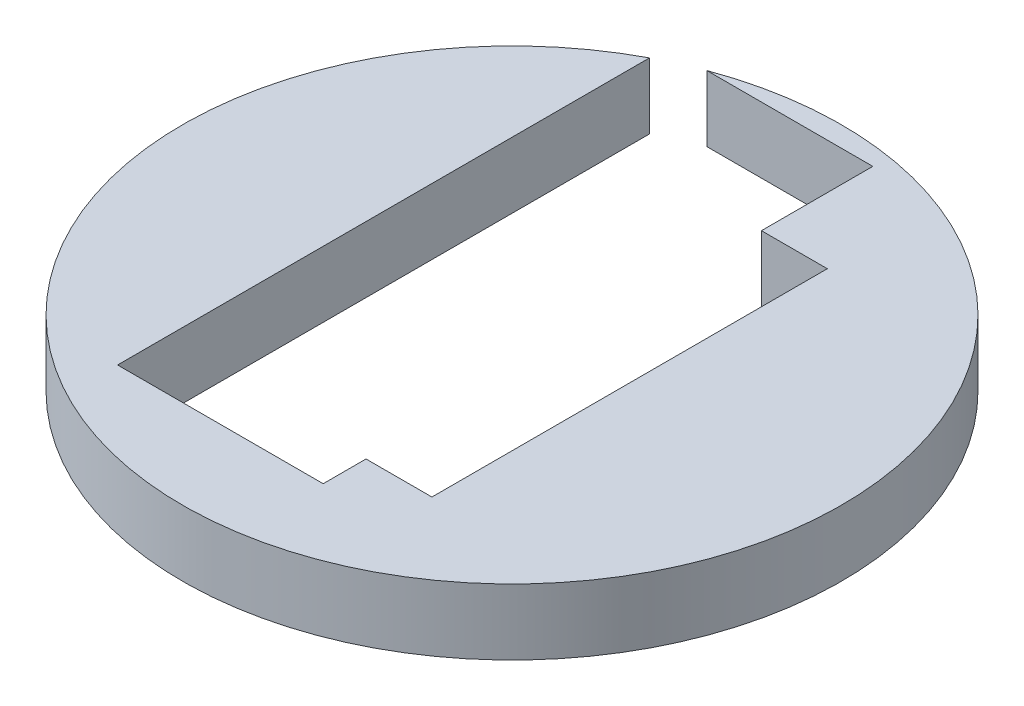
ISO-10303-21;
HEADER;
FILE_DESCRIPTION(('STEP AP214'),'2;1');
FILE_NAME('part.step','',(''),(''),'','','');
FILE_SCHEMA(('AUTOMOTIVE_DESIGN { 1 0 10303 214 1 1 1 1 }'));
ENDSEC;
DATA;
#1=APPLICATION_CONTEXT('core data for automotive mechanical design processes');
#2=APPLICATION_PROTOCOL_DEFINITION('international standard','automotive_design',2000,#1);
#3=PRODUCT_CONTEXT('',#1,'mechanical');
#4=PRODUCT('Part','Part','',(#3));
#5=PRODUCT_RELATED_PRODUCT_CATEGORY('part','',(#4));
#6=PRODUCT_DEFINITION_FORMATION('','',#4);
#7=PRODUCT_DEFINITION_CONTEXT('part definition',#1,'design');
#8=PRODUCT_DEFINITION('design','',#6,#7);
#9=PRODUCT_DEFINITION_SHAPE('','',#8);
#10=(LENGTH_UNIT() NAMED_UNIT(*) SI_UNIT(.MILLI.,.METRE.));
#11=(NAMED_UNIT(*) PLANE_ANGLE_UNIT() SI_UNIT($,.RADIAN.));
#12=(NAMED_UNIT(*) SI_UNIT($,.STERADIAN.) SOLID_ANGLE_UNIT());
#13=UNCERTAINTY_MEASURE_WITH_UNIT(LENGTH_MEASURE(1.E-05),#10,'distance_accuracy_value','');
#14=(GEOMETRIC_REPRESENTATION_CONTEXT(3) GLOBAL_UNCERTAINTY_ASSIGNED_CONTEXT((#13)) GLOBAL_UNIT_ASSIGNED_CONTEXT((#10,
#11,#12)) REPRESENTATION_CONTEXT('',''));
#15=CARTESIAN_POINT('',(0.,0.,0.));
#16=DIRECTION('',(0.,0.,1.));
#17=DIRECTION('',(1.,0.,0.));
#18=AXIS2_PLACEMENT_3D('',#15,#16,#17);
#19=CARTESIAN_POINT('',(-14.82725,-19.05,23.1775));
#20=DIRECTION('',(-1.,0.,0.));
#21=DIRECTION('',(0.,0.,1.));
#22=AXIS2_PLACEMENT_3D('',#19,#20,#21);
#23=PLANE('',#22);
#24=DIRECTION('',(0.,0.,1.));
#25=VECTOR('',#24,1.);
#26=CARTESIAN_POINT('',(-14.82725,-12.7,23.1775));
#27=LINE('',#26,#25);
#28=CARTESIAN_POINT('',(-14.82725,-12.7,-28.0751697668509));
#29=VERTEX_POINT('',#28);
#30=CARTESIAN_POINT('',(-14.82725,-12.7,23.1775));
#31=VERTEX_POINT('',#30);
#32=EDGE_CURVE('E138',#29,#31,#27,.T.);
#33=ORIENTED_EDGE('',*,*,#32,.T.);
#34=DIRECTION('',(0.,1.,0.));
#35=VECTOR('',#34,1.);
#36=CARTESIAN_POINT('',(-14.82725,-19.05,23.1775));
#37=LINE('',#36,#35);
#38=CARTESIAN_POINT('',(-14.82725,-19.05,23.1775));
#39=VERTEX_POINT('',#38);
#40=EDGE_CURVE('E11',#39,#31,#37,.T.);
#41=ORIENTED_EDGE('',*,*,#40,.F.);
#42=DIRECTION('',(0.,0.,1.));
#43=VECTOR('',#42,1.);
#44=CARTESIAN_POINT('',(-14.82725,-19.05,23.1775));
#45=LINE('',#44,#43);
#46=CARTESIAN_POINT('',(-14.82725,-19.05,-28.0751697668509));
#47=VERTEX_POINT('',#46);
#48=EDGE_CURVE('E154',#47,#39,#45,.T.);
#49=ORIENTED_EDGE('',*,*,#48,.F.);
#50=DIRECTION('',(0.,1.,0.));
#51=VECTOR('',#50,1.);
#52=CARTESIAN_POINT('',(-14.82725,-19.05,-28.0751697668509));
#53=LINE('',#52,#51);
#54=EDGE_CURVE('E134',#47,#29,#53,.T.);
#55=ORIENTED_EDGE('',*,*,#54,.T.);
#56=EDGE_LOOP('',(#33,#41,#49,#55));
#57=FACE_BOUND('',#56,.T.);
#58=ADVANCED_FACE('F36',(#57),#23,.F.);
#59=CARTESIAN_POINT('',(-14.82725,-19.05,23.1775));
#60=DIRECTION('',(0.,0.,1.));
#61=DIRECTION('',(1.,0.,0.));
#62=AXIS2_PLACEMENT_3D('',#59,#60,#61);
#63=PLANE('',#62);
#64=DIRECTION('',(1.,0.,0.));
#65=VECTOR('',#64,1.);
#66=CARTESIAN_POINT('',(-14.82725,-12.7,23.1775));
#67=LINE('',#66,#65);
#68=CARTESIAN_POINT('',(4.98475,-12.7,23.1775));
#69=VERTEX_POINT('',#68);
#70=EDGE_CURVE('E141',#31,#69,#67,.T.);
#71=ORIENTED_EDGE('',*,*,#70,.T.);
#72=DIRECTION('',(0.,1.,0.));
#73=VECTOR('',#72,1.);
#74=CARTESIAN_POINT('',(4.98475,-19.05,23.1775));
#75=LINE('',#74,#73);
#76=CARTESIAN_POINT('',(4.98475,-19.05,23.1775));
#77=VERTEX_POINT('',#76);
#78=EDGE_CURVE('E44',#77,#69,#75,.T.);
#79=ORIENTED_EDGE('',*,*,#78,.F.);
#80=DIRECTION('',(1.,0.,0.));
#81=VECTOR('',#80,1.);
#82=CARTESIAN_POINT('',(-14.82725,-19.05,23.1775));
#83=LINE('',#82,#81);
#84=EDGE_CURVE('E98',#39,#77,#83,.T.);
#85=ORIENTED_EDGE('',*,*,#84,.F.);
#86=ORIENTED_EDGE('',*,*,#40,.T.);
#87=EDGE_LOOP('',(#71,#79,#85,#86));
#88=FACE_BOUND('',#87,.T.);
#89=ADVANCED_FACE('F197',(#88),#63,.F.);
#90=CARTESIAN_POINT('',(4.98475,-19.05,23.1775));
#91=DIRECTION('',(1.,0.,0.));
#92=DIRECTION('',(0.,0.,-1.));
#93=AXIS2_PLACEMENT_3D('',#90,#91,#92);
#94=PLANE('',#93);
#95=DIRECTION('',(0.,0.,-1.));
#96=VECTOR('',#95,1.);
#97=CARTESIAN_POINT('',(4.98475,-12.7,23.1775));
#98=LINE('',#97,#96);
#99=CARTESIAN_POINT('',(4.98475,-12.7,19.05));
#100=VERTEX_POINT('',#99);
#101=EDGE_CURVE('E143',#69,#100,#98,.T.);
#102=ORIENTED_EDGE('',*,*,#101,.T.);
#103=DIRECTION('',(0.,1.,0.));
#104=VECTOR('',#103,1.);
#105=CARTESIAN_POINT('',(4.98475,-19.05,19.05));
#106=LINE('',#105,#104);
#107=CARTESIAN_POINT('',(4.98475,-19.05,19.05));
#108=VERTEX_POINT('',#107);
#109=EDGE_CURVE('E164',#108,#100,#106,.T.);
#110=ORIENTED_EDGE('',*,*,#109,.F.);
#111=DIRECTION('',(0.,0.,-1.));
#112=VECTOR('',#111,1.);
#113=CARTESIAN_POINT('',(4.98475,-19.05,23.1775));
#114=LINE('',#113,#112);
#115=EDGE_CURVE('E172',#77,#108,#114,.T.);
#116=ORIENTED_EDGE('',*,*,#115,.F.);
#117=ORIENTED_EDGE('',*,*,#78,.T.);
#118=EDGE_LOOP('',(#102,#110,#116,#117));
#119=FACE_BOUND('',#118,.T.);
#120=ADVANCED_FACE('F170',(#119),#94,.F.);
#121=CARTESIAN_POINT('',(4.98475,-19.05,19.05));
#122=DIRECTION('',(0.,0.,1.));
#123=DIRECTION('',(1.,0.,0.));
#124=AXIS2_PLACEMENT_3D('',#121,#122,#123);
#125=PLANE('',#124);
#126=DIRECTION('',(1.,0.,0.));
#127=VECTOR('',#126,1.);
#128=CARTESIAN_POINT('',(4.98475,-12.7,19.05));
#129=LINE('',#128,#127);
#130=CARTESIAN_POINT('',(11.33475,-12.7,19.05));
#131=VERTEX_POINT('',#130);
#132=EDGE_CURVE('E145',#100,#131,#129,.T.);
#133=ORIENTED_EDGE('',*,*,#132,.T.);
#134=DIRECTION('',(0.,1.,0.));
#135=VECTOR('',#134,1.);
#136=CARTESIAN_POINT('',(11.33475,-19.05,19.05));
#137=LINE('',#136,#135);
#138=CARTESIAN_POINT('',(11.33475,-19.05,19.05));
#139=VERTEX_POINT('',#138);
#140=EDGE_CURVE('E161',#139,#131,#137,.T.);
#141=ORIENTED_EDGE('',*,*,#140,.F.);
#142=DIRECTION('',(1.,0.,0.));
#143=VECTOR('',#142,1.);
#144=CARTESIAN_POINT('',(4.98475,-19.05,19.05));
#145=LINE('',#144,#143);
#146=EDGE_CURVE('E188',#108,#139,#145,.T.);
#147=ORIENTED_EDGE('',*,*,#146,.F.);
#148=ORIENTED_EDGE('',*,*,#109,.T.);
#149=EDGE_LOOP('',(#133,#141,#147,#148));
#150=FACE_BOUND('',#149,.T.);
#151=ADVANCED_FACE('F181',(#150),#125,.F.);
#152=CARTESIAN_POINT('',(11.33475,-19.05,19.05));
#153=DIRECTION('',(1.,0.,0.));
#154=DIRECTION('',(0.,0.,-1.));
#155=AXIS2_PLACEMENT_3D('',#152,#153,#154);
#156=PLANE('',#155);
#157=DIRECTION('',(0.,0.,-1.));
#158=VECTOR('',#157,1.);
#159=CARTESIAN_POINT('',(11.33475,-12.7,19.05));
#160=LINE('',#159,#158);
#161=CARTESIAN_POINT('',(11.33475,-12.7,-19.05));
#162=VERTEX_POINT('',#161);
#163=EDGE_CURVE('E147',#131,#162,#160,.T.);
#164=ORIENTED_EDGE('',*,*,#163,.T.);
#165=DIRECTION('',(0.,1.,0.));
#166=VECTOR('',#165,1.);
#167=CARTESIAN_POINT('',(11.33475,-19.05,-19.05));
#168=LINE('',#167,#166);
#169=CARTESIAN_POINT('',(11.33475,-19.05,-19.05));
#170=VERTEX_POINT('',#169);
#171=EDGE_CURVE('E158',#170,#162,#168,.T.);
#172=ORIENTED_EDGE('',*,*,#171,.F.);
#173=DIRECTION('',(0.,0.,-1.));
#174=VECTOR('',#173,1.);
#175=CARTESIAN_POINT('',(11.33475,-19.05,19.05));
#176=LINE('',#175,#174);
#177=EDGE_CURVE('E187',#139,#170,#176,.T.);
#178=ORIENTED_EDGE('',*,*,#177,.F.);
#179=ORIENTED_EDGE('',*,*,#140,.T.);
#180=EDGE_LOOP('',(#164,#172,#178,#179));
#181=FACE_BOUND('',#180,.T.);
#182=ADVANCED_FACE('F185',(#181),#156,.F.);
#183=CARTESIAN_POINT('',(4.98475,-19.05,-19.05));
#184=DIRECTION('',(0.,0.,-1.));
#185=DIRECTION('',(-1.,0.,0.));
#186=AXIS2_PLACEMENT_3D('',#183,#184,#185);
#187=PLANE('',#186);
#188=DIRECTION('',(-1.,0.,0.));
#189=VECTOR('',#188,1.);
#190=CARTESIAN_POINT('',(4.98475,-12.7,-19.05));
#191=LINE('',#190,#189);
#192=CARTESIAN_POINT('',(4.98475,-12.7,-19.05));
#193=VERTEX_POINT('',#192);
#194=EDGE_CURVE('E149',#162,#193,#191,.T.);
#195=ORIENTED_EDGE('',*,*,#194,.T.);
#196=DIRECTION('',(0.,1.,0.));
#197=VECTOR('',#196,1.);
#198=CARTESIAN_POINT('',(4.98475,-19.05,-19.05));
#199=LINE('',#198,#197);
#200=CARTESIAN_POINT('',(4.98475,-19.05,-19.05));
#201=VERTEX_POINT('',#200);
#202=EDGE_CURVE('E129',#201,#193,#199,.T.);
#203=ORIENTED_EDGE('',*,*,#202,.F.);
#204=DIRECTION('',(-1.,0.,0.));
#205=VECTOR('',#204,1.);
#206=CARTESIAN_POINT('',(4.98475,-19.05,-19.05));
#207=LINE('',#206,#205);
#208=EDGE_CURVE('E120',#170,#201,#207,.T.);
#209=ORIENTED_EDGE('',*,*,#208,.F.);
#210=ORIENTED_EDGE('',*,*,#171,.T.);
#211=EDGE_LOOP('',(#195,#203,#209,#210));
#212=FACE_BOUND('',#211,.T.);
#213=ADVANCED_FACE('F209',(#212),#187,.F.);
#214=CARTESIAN_POINT('',(4.98475,-19.05,-19.05));
#215=DIRECTION('',(1.,0.,0.));
#216=DIRECTION('',(0.,0.,-1.));
#217=AXIS2_PLACEMENT_3D('',#214,#215,#216);
#218=PLANE('',#217);
#219=DIRECTION('',(0.,0.,-1.));
#220=VECTOR('',#219,1.);
#221=CARTESIAN_POINT('',(4.98475,-12.7,-19.05));
#222=LINE('',#221,#220);
#223=CARTESIAN_POINT('',(4.98475,-12.7,-29.7815));
#224=VERTEX_POINT('',#223);
#225=EDGE_CURVE('E128',#193,#224,#222,.T.);
#226=ORIENTED_EDGE('',*,*,#225,.T.);
#227=DIRECTION('',(0.,1.,0.));
#228=VECTOR('',#227,1.);
#229=CARTESIAN_POINT('',(4.98475,-19.05,-29.7815));
#230=LINE('',#229,#228);
#231=CARTESIAN_POINT('',(4.98475,-19.05,-29.7815));
#232=VERTEX_POINT('',#231);
#233=EDGE_CURVE('E125',#232,#224,#230,.T.);
#234=ORIENTED_EDGE('',*,*,#233,.F.);
#235=DIRECTION('',(0.,0.,-1.));
#236=VECTOR('',#235,1.);
#237=CARTESIAN_POINT('',(4.98475,-19.05,-19.05));
#238=LINE('',#237,#236);
#239=EDGE_CURVE('E114',#201,#232,#238,.T.);
#240=ORIENTED_EDGE('',*,*,#239,.F.);
#241=ORIENTED_EDGE('',*,*,#202,.T.);
#242=EDGE_LOOP('',(#226,#234,#240,#241));
#243=FACE_BOUND('',#242,.T.);
#244=ADVANCED_FACE('F126',(#243),#218,.F.);
#245=CARTESIAN_POINT('',(-11.0056693458417,-19.05,-29.7815));
#246=DIRECTION('',(0.,0.,-1.));
#247=DIRECTION('',(-1.,0.,0.));
#248=AXIS2_PLACEMENT_3D('',#245,#246,#247);
#249=PLANE('',#248);
#250=DIRECTION('',(-1.,0.,0.));
#251=VECTOR('',#250,1.);
#252=CARTESIAN_POINT('',(-11.0056693458417,-12.7,-29.7815));
#253=LINE('',#252,#251);
#254=CARTESIAN_POINT('',(-11.0056693458417,-12.7,-29.7815));
#255=VERTEX_POINT('',#254);
#256=EDGE_CURVE('E84',#224,#255,#253,.T.);
#257=ORIENTED_EDGE('',*,*,#256,.T.);
#258=DIRECTION('',(0.,1.,0.));
#259=VECTOR('',#258,1.);
#260=CARTESIAN_POINT('',(-11.0056693458417,-19.05,-29.7815));
#261=LINE('',#260,#259);
#262=CARTESIAN_POINT('',(-11.0056693458417,-19.05,-29.7815));
#263=VERTEX_POINT('',#262);
#264=EDGE_CURVE('E130',#263,#255,#261,.T.);
#265=ORIENTED_EDGE('',*,*,#264,.F.);
#266=DIRECTION('',(-1.,0.,0.));
#267=VECTOR('',#266,1.);
#268=CARTESIAN_POINT('',(-11.0056693458417,-19.05,-29.7815));
#269=LINE('',#268,#267);
#270=EDGE_CURVE('E118',#232,#263,#269,.T.);
#271=ORIENTED_EDGE('',*,*,#270,.F.);
#272=ORIENTED_EDGE('',*,*,#233,.T.);
#273=EDGE_LOOP('',(#257,#265,#271,#272));
#274=FACE_BOUND('',#273,.T.);
#275=ADVANCED_FACE('F132',(#274),#249,.F.);
#276=CARTESIAN_POINT('',(0.,-19.05,0.));
#277=DIRECTION('',(0.,1.,0.));
#278=DIRECTION('',(0.,0.,1.));
#279=AXIS2_PLACEMENT_3D('',#276,#277,#278);
#280=CYLINDRICAL_SURFACE('',#279,31.75);
#281=CARTESIAN_POINT('',(0.,-12.7,0.));
#282=DIRECTION('',(0.,-1.,0.));
#283=DIRECTION('',(0.,0.,-1.));
#284=AXIS2_PLACEMENT_3D('',#281,#282,#283);
#285=CIRCLE('',#284,31.75);
#286=EDGE_CURVE('E90',#255,#29,#285,.T.);
#287=ORIENTED_EDGE('',*,*,#286,.T.);
#288=ORIENTED_EDGE('',*,*,#54,.F.);
#289=CARTESIAN_POINT('',(0.,-19.05,0.));
#290=DIRECTION('',(0.,-1.,0.));
#291=DIRECTION('',(0.,0.,-1.));
#292=AXIS2_PLACEMENT_3D('',#289,#290,#291);
#293=CIRCLE('',#292,31.75);
#294=EDGE_CURVE('E52',#263,#47,#293,.T.);
#295=ORIENTED_EDGE('',*,*,#294,.F.);
#296=ORIENTED_EDGE('',*,*,#264,.T.);
#297=EDGE_LOOP('',(#287,#288,#295,#296));
#298=FACE_BOUND('',#297,.T.);
#299=ADVANCED_FACE('F217',(#298),#280,.T.);
#300=CARTESIAN_POINT('',(0.,-19.05,0.));
#301=DIRECTION('',(0.,-1.,0.));
#302=DIRECTION('',(0.,0.,-1.));
#303=AXIS2_PLACEMENT_3D('',#300,#301,#302);
#304=PLANE('',#303);
#305=ORIENTED_EDGE('',*,*,#48,.T.);
#306=ORIENTED_EDGE('',*,*,#84,.T.);
#307=ORIENTED_EDGE('',*,*,#115,.T.);
#308=ORIENTED_EDGE('',*,*,#146,.T.);
#309=ORIENTED_EDGE('',*,*,#177,.T.);
#310=ORIENTED_EDGE('',*,*,#208,.T.);
#311=ORIENTED_EDGE('',*,*,#239,.T.);
#312=ORIENTED_EDGE('',*,*,#270,.T.);
#313=ORIENTED_EDGE('',*,*,#294,.T.);
#314=EDGE_LOOP('',(#305,#306,#307,#308,#309,#310,#311,#312,#313));
#315=FACE_BOUND('',#314,.T.);
#316=ADVANCED_FACE('F116',(#315),#304,.T.);
#317=CARTESIAN_POINT('',(0.,-12.7,0.));
#318=DIRECTION('',(0.,-1.,0.));
#319=DIRECTION('',(0.,0.,-1.));
#320=AXIS2_PLACEMENT_3D('',#317,#318,#319);
#321=PLANE('',#320);
#322=ORIENTED_EDGE('',*,*,#32,.F.);
#323=ORIENTED_EDGE('',*,*,#286,.F.);
#324=ORIENTED_EDGE('',*,*,#256,.F.);
#325=ORIENTED_EDGE('',*,*,#225,.F.);
#326=ORIENTED_EDGE('',*,*,#194,.F.);
#327=ORIENTED_EDGE('',*,*,#163,.F.);
#328=ORIENTED_EDGE('',*,*,#132,.F.);
#329=ORIENTED_EDGE('',*,*,#101,.F.);
#330=ORIENTED_EDGE('',*,*,#70,.F.);
#331=EDGE_LOOP('',(#322,#323,#324,#325,#326,#327,#328,#329,#330));
#332=FACE_BOUND('',#331,.T.);
#333=ADVANCED_FACE('F176',(#332),#321,.F.);
#334=CLOSED_SHELL('',(#58,#89,#120,#151,#182,#213,#244,#275,#299,#316,#333));
#335=MANIFOLD_SOLID_BREP('B2',#334);
#336=ADVANCED_BREP_SHAPE_REPRESENTATION('',(#18,#335),#14);
#337=SHAPE_DEFINITION_REPRESENTATION(#9,#336);
ENDSEC;
END-ISO-10303-21;
